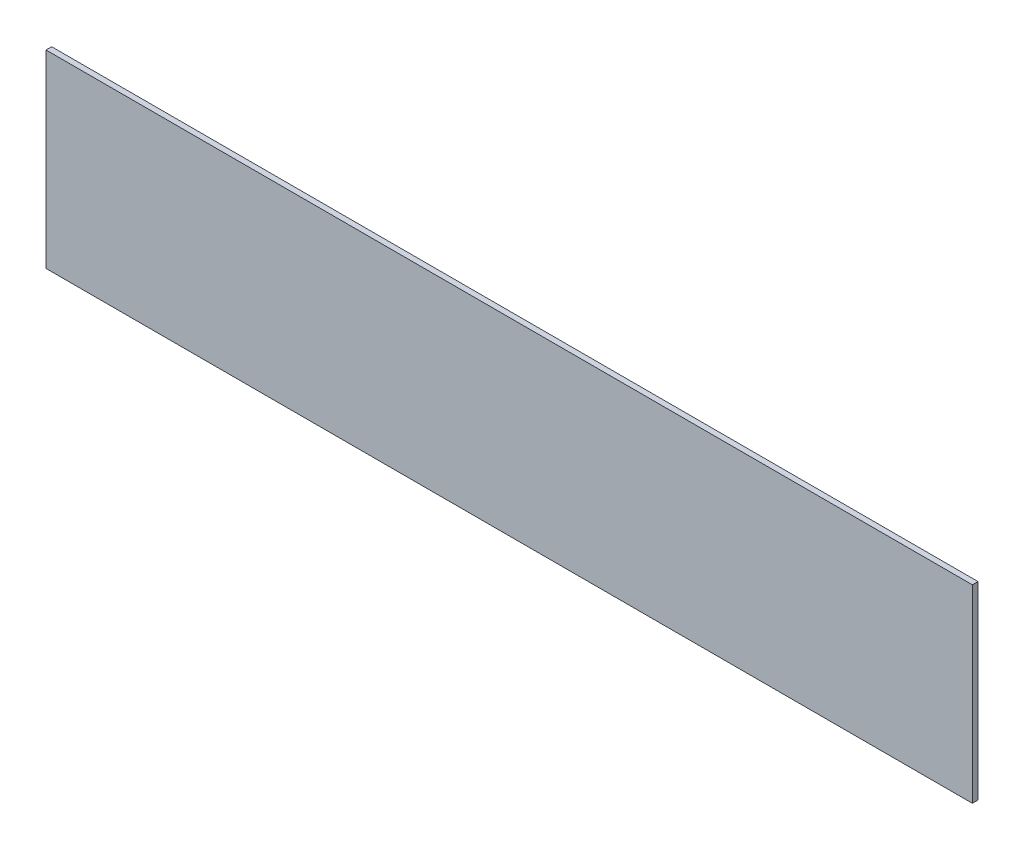
ISO-10303-21;
HEADER;
FILE_DESCRIPTION(('STEP AP214'),'2;1');
FILE_NAME('part.step','',(''),(''),'','','');
FILE_SCHEMA(('AUTOMOTIVE_DESIGN { 1 0 10303 214 1 1 1 1 }'));
ENDSEC;
DATA;
#1=APPLICATION_CONTEXT('core data for automotive mechanical design processes');
#2=APPLICATION_PROTOCOL_DEFINITION('international standard','automotive_design',2000,#1);
#3=PRODUCT_CONTEXT('',#1,'mechanical');
#4=PRODUCT('Part','Part','',(#3));
#5=PRODUCT_RELATED_PRODUCT_CATEGORY('part','',(#4));
#6=PRODUCT_DEFINITION_FORMATION('','',#4);
#7=PRODUCT_DEFINITION_CONTEXT('part definition',#1,'design');
#8=PRODUCT_DEFINITION('design','',#6,#7);
#9=PRODUCT_DEFINITION_SHAPE('','',#8);
#10=(LENGTH_UNIT() NAMED_UNIT(*) SI_UNIT(.MILLI.,.METRE.));
#11=(NAMED_UNIT(*) PLANE_ANGLE_UNIT() SI_UNIT($,.RADIAN.));
#12=(NAMED_UNIT(*) SI_UNIT($,.STERADIAN.) SOLID_ANGLE_UNIT());
#13=UNCERTAINTY_MEASURE_WITH_UNIT(LENGTH_MEASURE(1.E-05),#10,'distance_accuracy_value','');
#14=(GEOMETRIC_REPRESENTATION_CONTEXT(3) GLOBAL_UNCERTAINTY_ASSIGNED_CONTEXT((#13)) GLOBAL_UNIT_ASSIGNED_CONTEXT((#10,
#11,#12)) REPRESENTATION_CONTEXT('',''));
#15=CARTESIAN_POINT('',(0.,0.,0.));
#16=DIRECTION('',(0.,0.,1.));
#17=DIRECTION('',(1.,0.,0.));
#18=AXIS2_PLACEMENT_3D('',#15,#16,#17);
#19=CARTESIAN_POINT('',(-520.7,-106.3625,6.35));
#20=DIRECTION('',(0.,1.,0.));
#21=DIRECTION('',(0.,0.,1.));
#22=AXIS2_PLACEMENT_3D('',#19,#20,#21);
#23=PLANE('',#22);
#24=DIRECTION('',(1.,0.,0.));
#25=VECTOR('',#24,1.);
#26=CARTESIAN_POINT('',(-520.7,-106.3625,0.));
#27=LINE('',#26,#25);
#28=CARTESIAN_POINT('',(-520.7,-106.3625,0.));
#29=VERTEX_POINT('',#28);
#30=CARTESIAN_POINT('',(520.7,-106.3625,0.));
#31=VERTEX_POINT('',#30);
#32=EDGE_CURVE('E99',#29,#31,#27,.T.);
#33=ORIENTED_EDGE('',*,*,#32,.T.);
#34=DIRECTION('',(0.,0.,-1.));
#35=VECTOR('',#34,1.);
#36=CARTESIAN_POINT('',(520.7,-106.3625,6.35));
#37=LINE('',#36,#35);
#38=CARTESIAN_POINT('',(520.7,-106.3625,6.35));
#39=VERTEX_POINT('',#38);
#40=EDGE_CURVE('E11',#39,#31,#37,.T.);
#41=ORIENTED_EDGE('',*,*,#40,.F.);
#42=DIRECTION('',(1.,0.,0.));
#43=VECTOR('',#42,1.);
#44=CARTESIAN_POINT('',(-520.7,-106.3625,6.35));
#45=LINE('',#44,#43);
#46=CARTESIAN_POINT('',(-520.7,-106.3625,6.35));
#47=VERTEX_POINT('',#46);
#48=EDGE_CURVE('E76',#47,#39,#45,.T.);
#49=ORIENTED_EDGE('',*,*,#48,.F.);
#50=DIRECTION('',(0.,0.,-1.));
#51=VECTOR('',#50,1.);
#52=CARTESIAN_POINT('',(-520.7,-106.3625,6.35));
#53=LINE('',#52,#51);
#54=EDGE_CURVE('E95',#47,#29,#53,.T.);
#55=ORIENTED_EDGE('',*,*,#54,.T.);
#56=EDGE_LOOP('',(#33,#41,#49,#55));
#57=FACE_BOUND('',#56,.T.);
#58=ADVANCED_FACE('F37',(#57),#23,.F.);
#59=CARTESIAN_POINT('',(520.7,106.3625,6.35));
#60=DIRECTION('',(1.,0.,0.));
#61=DIRECTION('',(0.,0.,-1.));
#62=AXIS2_PLACEMENT_3D('',#59,#60,#61);
#63=PLANE('',#62);
#64=DIRECTION('',(0.,-1.,0.));
#65=VECTOR('',#64,1.);
#66=CARTESIAN_POINT('',(520.7,106.3625,0.));
#67=LINE('',#66,#65);
#68=CARTESIAN_POINT('',(520.7,106.3625,0.));
#69=VERTEX_POINT('',#68);
#70=EDGE_CURVE('E85',#69,#31,#67,.T.);
#71=ORIENTED_EDGE('',*,*,#70,.F.);
#72=DIRECTION('',(0.,0.,-1.));
#73=VECTOR('',#72,1.);
#74=CARTESIAN_POINT('',(520.7,106.3625,6.35));
#75=LINE('',#74,#73);
#76=CARTESIAN_POINT('',(520.7,106.3625,6.35));
#77=VERTEX_POINT('',#76);
#78=EDGE_CURVE('E45',#77,#69,#75,.T.);
#79=ORIENTED_EDGE('',*,*,#78,.F.);
#80=DIRECTION('',(0.,-1.,0.));
#81=VECTOR('',#80,1.);
#82=CARTESIAN_POINT('',(520.7,106.3625,6.35));
#83=LINE('',#82,#81);
#84=EDGE_CURVE('E83',#77,#39,#83,.T.);
#85=ORIENTED_EDGE('',*,*,#84,.T.);
#86=ORIENTED_EDGE('',*,*,#40,.T.);
#87=EDGE_LOOP('',(#71,#79,#85,#86));
#88=FACE_BOUND('',#87,.T.);
#89=ADVANCED_FACE('F82',(#88),#63,.T.);
#90=CARTESIAN_POINT('',(-520.7,106.3625,6.35));
#91=DIRECTION('',(0.,1.,0.));
#92=DIRECTION('',(0.,0.,1.));
#93=AXIS2_PLACEMENT_3D('',#90,#91,#92);
#94=PLANE('',#93);
#95=DIRECTION('',(1.,0.,0.));
#96=VECTOR('',#95,1.);
#97=CARTESIAN_POINT('',(-520.7,106.3625,0.));
#98=LINE('',#97,#96);
#99=CARTESIAN_POINT('',(-520.7,106.3625,0.));
#100=VERTEX_POINT('',#99);
#101=EDGE_CURVE('E103',#100,#69,#98,.T.);
#102=ORIENTED_EDGE('',*,*,#101,.F.);
#103=DIRECTION('',(0.,0.,-1.));
#104=VECTOR('',#103,1.);
#105=CARTESIAN_POINT('',(-520.7,106.3625,6.35));
#106=LINE('',#105,#104);
#107=CARTESIAN_POINT('',(-520.7,106.3625,6.35));
#108=VERTEX_POINT('',#107);
#109=EDGE_CURVE('E68',#108,#100,#106,.T.);
#110=ORIENTED_EDGE('',*,*,#109,.F.);
#111=DIRECTION('',(1.,0.,0.));
#112=VECTOR('',#111,1.);
#113=CARTESIAN_POINT('',(-520.7,106.3625,6.35));
#114=LINE('',#113,#112);
#115=EDGE_CURVE('E91',#108,#77,#114,.T.);
#116=ORIENTED_EDGE('',*,*,#115,.T.);
#117=ORIENTED_EDGE('',*,*,#78,.T.);
#118=EDGE_LOOP('',(#102,#110,#116,#117));
#119=FACE_BOUND('',#118,.T.);
#120=ADVANCED_FACE('F93',(#119),#94,.T.);
#121=CARTESIAN_POINT('',(-520.7,106.3625,6.35));
#122=DIRECTION('',(1.,0.,0.));
#123=DIRECTION('',(0.,0.,-1.));
#124=AXIS2_PLACEMENT_3D('',#121,#122,#123);
#125=PLANE('',#124);
#126=DIRECTION('',(0.,-1.,0.));
#127=VECTOR('',#126,1.);
#128=CARTESIAN_POINT('',(-520.7,106.3625,0.));
#129=LINE('',#128,#127);
#130=EDGE_CURVE('E71',#100,#29,#129,.T.);
#131=ORIENTED_EDGE('',*,*,#130,.T.);
#132=ORIENTED_EDGE('',*,*,#54,.F.);
#133=DIRECTION('',(0.,-1.,0.));
#134=VECTOR('',#133,1.);
#135=CARTESIAN_POINT('',(-520.7,106.3625,6.35));
#136=LINE('',#135,#134);
#137=EDGE_CURVE('E53',#108,#47,#136,.T.);
#138=ORIENTED_EDGE('',*,*,#137,.F.);
#139=ORIENTED_EDGE('',*,*,#109,.T.);
#140=EDGE_LOOP('',(#131,#132,#138,#139));
#141=FACE_BOUND('',#140,.T.);
#142=ADVANCED_FACE('F116',(#141),#125,.F.);
#143=CARTESIAN_POINT('',(0.,0.,6.35));
#144=DIRECTION('',(0.,0.,-1.));
#145=DIRECTION('',(-1.,0.,0.));
#146=AXIS2_PLACEMENT_3D('',#143,#144,#145);
#147=PLANE('',#146);
#148=ORIENTED_EDGE('',*,*,#48,.T.);
#149=ORIENTED_EDGE('',*,*,#84,.F.);
#150=ORIENTED_EDGE('',*,*,#115,.F.);
#151=ORIENTED_EDGE('',*,*,#137,.T.);
#152=EDGE_LOOP('',(#148,#149,#150,#151));
#153=FACE_BOUND('',#152,.T.);
#154=ADVANCED_FACE('F90',(#153),#147,.F.);
#155=CARTESIAN_POINT('',(0.,0.,0.));
#156=DIRECTION('',(0.,0.,-1.));
#157=DIRECTION('',(-1.,0.,0.));
#158=AXIS2_PLACEMENT_3D('',#155,#156,#157);
#159=PLANE('',#158);
#160=ORIENTED_EDGE('',*,*,#32,.F.);
#161=ORIENTED_EDGE('',*,*,#130,.F.);
#162=ORIENTED_EDGE('',*,*,#101,.T.);
#163=ORIENTED_EDGE('',*,*,#70,.T.);
#164=EDGE_LOOP('',(#160,#161,#162,#163));
#165=FACE_BOUND('',#164,.T.);
#166=ADVANCED_FACE('F110',(#165),#159,.T.);
#167=CLOSED_SHELL('',(#58,#89,#120,#142,#154,#166));
#168=MANIFOLD_SOLID_BREP('B2',#167);
#169=ADVANCED_BREP_SHAPE_REPRESENTATION('',(#18,#168),#14);
#170=SHAPE_DEFINITION_REPRESENTATION(#9,#169);
ENDSEC;
END-ISO-10303-21;
